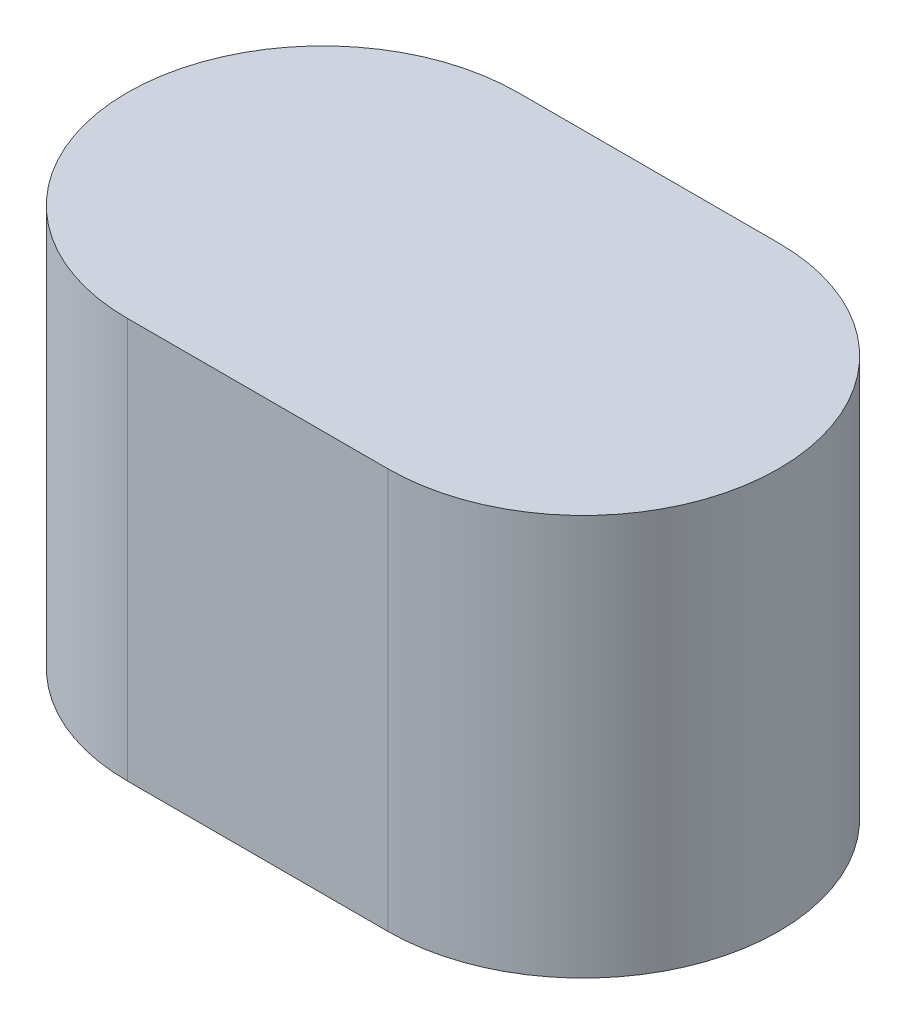
ISO-10303-21;
HEADER;
FILE_DESCRIPTION(('STEP AP214'),'2;1');
FILE_NAME('part.step','',(''),(''),'','','');
FILE_SCHEMA(('AUTOMOTIVE_DESIGN { 1 0 10303 214 1 1 1 1 }'));
ENDSEC;
DATA;
#1=APPLICATION_CONTEXT('core data for automotive mechanical design processes');
#2=APPLICATION_PROTOCOL_DEFINITION('international standard','automotive_design',2000,#1);
#3=PRODUCT_CONTEXT('',#1,'mechanical');
#4=PRODUCT('Part','Part','',(#3));
#5=PRODUCT_RELATED_PRODUCT_CATEGORY('part','',(#4));
#6=PRODUCT_DEFINITION_FORMATION('','',#4);
#7=PRODUCT_DEFINITION_CONTEXT('part definition',#1,'design');
#8=PRODUCT_DEFINITION('design','',#6,#7);
#9=PRODUCT_DEFINITION_SHAPE('','',#8);
#10=(LENGTH_UNIT() NAMED_UNIT(*) SI_UNIT(.MILLI.,.METRE.));
#11=(NAMED_UNIT(*) PLANE_ANGLE_UNIT() SI_UNIT($,.RADIAN.));
#12=(NAMED_UNIT(*) SI_UNIT($,.STERADIAN.) SOLID_ANGLE_UNIT());
#13=UNCERTAINTY_MEASURE_WITH_UNIT(LENGTH_MEASURE(1.E-05),#10,'distance_accuracy_value','');
#14=(GEOMETRIC_REPRESENTATION_CONTEXT(3) GLOBAL_UNCERTAINTY_ASSIGNED_CONTEXT((#13)) GLOBAL_UNIT_ASSIGNED_CONTEXT((#10,
#11,#12)) REPRESENTATION_CONTEXT('',''));
#15=CARTESIAN_POINT('',(0.,0.,0.));
#16=DIRECTION('',(0.,0.,1.));
#17=DIRECTION('',(1.,0.,0.));
#18=AXIS2_PLACEMENT_3D('',#15,#16,#17);
#19=CARTESIAN_POINT('',(0.,6.15,0.));
#20=DIRECTION('',(0.,-1.,0.));
#21=DIRECTION('',(0.,0.,-1.));
#22=AXIS2_PLACEMENT_3D('',#19,#20,#21);
#23=CYLINDRICAL_SURFACE('',#22,3.);
#24=CARTESIAN_POINT('',(0.,0.,0.));
#25=DIRECTION('',(0.,1.,0.));
#26=DIRECTION('',(0.,0.,1.));
#27=AXIS2_PLACEMENT_3D('',#24,#25,#26);
#28=CIRCLE('',#27,3.);
#29=CARTESIAN_POINT('',(0.,0.,-3.));
#30=VERTEX_POINT('',#29);
#31=CARTESIAN_POINT('',(0.,0.,3.));
#32=VERTEX_POINT('',#31);
#33=EDGE_CURVE('E95',#30,#32,#28,.T.);
#34=ORIENTED_EDGE('',*,*,#33,.T.);
#35=DIRECTION('',(0.,-1.,0.));
#36=VECTOR('',#35,1.);
#37=CARTESIAN_POINT('',(0.,6.15,3.));
#38=LINE('',#37,#36);
#39=CARTESIAN_POINT('',(0.,6.15,3.));
#40=VERTEX_POINT('',#39);
#41=EDGE_CURVE('E11',#40,#32,#38,.T.);
#42=ORIENTED_EDGE('',*,*,#41,.F.);
#43=CARTESIAN_POINT('',(0.,6.15,0.));
#44=DIRECTION('',(0.,1.,0.));
#45=DIRECTION('',(0.,0.,1.));
#46=AXIS2_PLACEMENT_3D('',#43,#44,#45);
#47=CIRCLE('',#46,3.);
#48=CARTESIAN_POINT('',(0.,6.15,-3.));
#49=VERTEX_POINT('',#48);
#50=EDGE_CURVE('E83',#49,#40,#47,.T.);
#51=ORIENTED_EDGE('',*,*,#50,.F.);
#52=DIRECTION('',(0.,-1.,0.));
#53=VECTOR('',#52,1.);
#54=CARTESIAN_POINT('',(0.,6.15,-3.));
#55=LINE('',#54,#53);
#56=EDGE_CURVE('E91',#49,#30,#55,.T.);
#57=ORIENTED_EDGE('',*,*,#56,.T.);
#58=EDGE_LOOP('',(#34,#42,#51,#57));
#59=FACE_BOUND('',#58,.T.);
#60=ADVANCED_FACE('F32',(#59),#23,.T.);
#61=CARTESIAN_POINT('',(0.,6.15,3.));
#62=DIRECTION('',(0.,0.,-1.));
#63=DIRECTION('',(-1.,0.,0.));
#64=AXIS2_PLACEMENT_3D('',#61,#62,#63);
#65=PLANE('',#64);
#66=DIRECTION('',(1.,0.,0.));
#67=VECTOR('',#66,1.);
#68=CARTESIAN_POINT('',(0.,0.,3.));
#69=LINE('',#68,#67);
#70=CARTESIAN_POINT('',(4.,0.,3.));
#71=VERTEX_POINT('',#70);
#72=EDGE_CURVE('E87',#32,#71,#69,.T.);
#73=ORIENTED_EDGE('',*,*,#72,.T.);
#74=DIRECTION('',(0.,-1.,0.));
#75=VECTOR('',#74,1.);
#76=CARTESIAN_POINT('',(4.,6.15,3.));
#77=LINE('',#76,#75);
#78=CARTESIAN_POINT('',(4.,6.15,3.));
#79=VERTEX_POINT('',#78);
#80=EDGE_CURVE('E40',#79,#71,#77,.T.);
#81=ORIENTED_EDGE('',*,*,#80,.F.);
#82=DIRECTION('',(1.,0.,0.));
#83=VECTOR('',#82,1.);
#84=CARTESIAN_POINT('',(0.,6.15,3.));
#85=LINE('',#84,#83);
#86=EDGE_CURVE('E78',#40,#79,#85,.T.);
#87=ORIENTED_EDGE('',*,*,#86,.F.);
#88=ORIENTED_EDGE('',*,*,#41,.T.);
#89=EDGE_LOOP('',(#73,#81,#87,#88));
#90=FACE_BOUND('',#89,.T.);
#91=ADVANCED_FACE('F86',(#90),#65,.F.);
#92=CARTESIAN_POINT('',(4.,6.15,0.));
#93=DIRECTION('',(0.,-1.,0.));
#94=DIRECTION('',(0.,0.,-1.));
#95=AXIS2_PLACEMENT_3D('',#92,#93,#94);
#96=CYLINDRICAL_SURFACE('',#95,3.);
#97=CARTESIAN_POINT('',(4.,0.,0.));
#98=DIRECTION('',(0.,1.,0.));
#99=DIRECTION('',(0.,0.,1.));
#100=AXIS2_PLACEMENT_3D('',#97,#98,#99);
#101=CIRCLE('',#100,3.);
#102=CARTESIAN_POINT('',(4.,0.,-3.));
#103=VERTEX_POINT('',#102);
#104=EDGE_CURVE('E65',#71,#103,#101,.T.);
#105=ORIENTED_EDGE('',*,*,#104,.T.);
#106=DIRECTION('',(0.,-1.,0.));
#107=VECTOR('',#106,1.);
#108=CARTESIAN_POINT('',(4.,6.15,-3.));
#109=LINE('',#108,#107);
#110=CARTESIAN_POINT('',(4.,6.15,-3.));
#111=VERTEX_POINT('',#110);
#112=EDGE_CURVE('E88',#111,#103,#109,.T.);
#113=ORIENTED_EDGE('',*,*,#112,.F.);
#114=CARTESIAN_POINT('',(4.,6.15,0.));
#115=DIRECTION('',(0.,1.,0.));
#116=DIRECTION('',(0.,0.,1.));
#117=AXIS2_PLACEMENT_3D('',#114,#115,#116);
#118=CIRCLE('',#117,3.);
#119=EDGE_CURVE('E81',#79,#111,#118,.T.);
#120=ORIENTED_EDGE('',*,*,#119,.F.);
#121=ORIENTED_EDGE('',*,*,#80,.T.);
#122=EDGE_LOOP('',(#105,#113,#120,#121));
#123=FACE_BOUND('',#122,.T.);
#124=ADVANCED_FACE('F89',(#123),#96,.T.);
#125=CARTESIAN_POINT('',(0.,6.15,-3.));
#126=DIRECTION('',(0.,0.,1.));
#127=DIRECTION('',(1.,0.,0.));
#128=AXIS2_PLACEMENT_3D('',#125,#126,#127);
#129=PLANE('',#128);
#130=DIRECTION('',(-1.,0.,0.));
#131=VECTOR('',#130,1.);
#132=CARTESIAN_POINT('',(0.,0.,-3.));
#133=LINE('',#132,#131);
#134=EDGE_CURVE('E71',#103,#30,#133,.T.);
#135=ORIENTED_EDGE('',*,*,#134,.T.);
#136=ORIENTED_EDGE('',*,*,#56,.F.);
#137=DIRECTION('',(-1.,0.,0.));
#138=VECTOR('',#137,1.);
#139=CARTESIAN_POINT('',(0.,6.15,-3.));
#140=LINE('',#139,#138);
#141=EDGE_CURVE('E48',#111,#49,#140,.T.);
#142=ORIENTED_EDGE('',*,*,#141,.F.);
#143=ORIENTED_EDGE('',*,*,#112,.T.);
#144=EDGE_LOOP('',(#135,#136,#142,#143));
#145=FACE_BOUND('',#144,.T.);
#146=ADVANCED_FACE('F102',(#145),#129,.F.);
#147=CARTESIAN_POINT('',(0.,6.15,0.));
#148=DIRECTION('',(0.,1.,0.));
#149=DIRECTION('',(0.,0.,1.));
#150=AXIS2_PLACEMENT_3D('',#147,#148,#149);
#151=PLANE('',#150);
#152=ORIENTED_EDGE('',*,*,#50,.T.);
#153=ORIENTED_EDGE('',*,*,#86,.T.);
#154=ORIENTED_EDGE('',*,*,#119,.T.);
#155=ORIENTED_EDGE('',*,*,#141,.T.);
#156=EDGE_LOOP('',(#152,#153,#154,#155));
#157=FACE_BOUND('',#156,.T.);
#158=ADVANCED_FACE('F79',(#157),#151,.T.);
#159=CARTESIAN_POINT('',(0.,0.,0.));
#160=DIRECTION('',(0.,1.,0.));
#161=DIRECTION('',(0.,0.,1.));
#162=AXIS2_PLACEMENT_3D('',#159,#160,#161);
#163=PLANE('',#162);
#164=ORIENTED_EDGE('',*,*,#33,.F.);
#165=ORIENTED_EDGE('',*,*,#134,.F.);
#166=ORIENTED_EDGE('',*,*,#104,.F.);
#167=ORIENTED_EDGE('',*,*,#72,.F.);
#168=EDGE_LOOP('',(#164,#165,#166,#167));
#169=FACE_BOUND('',#168,.T.);
#170=ADVANCED_FACE('F105',(#169),#163,.F.);
#171=CLOSED_SHELL('',(#60,#91,#124,#146,#158,#170));
#172=MANIFOLD_SOLID_BREP('B2',#171);
#173=ADVANCED_BREP_SHAPE_REPRESENTATION('',(#18,#172),#14);
#174=SHAPE_DEFINITION_REPRESENTATION(#9,#173);
ENDSEC;
END-ISO-10303-21;
